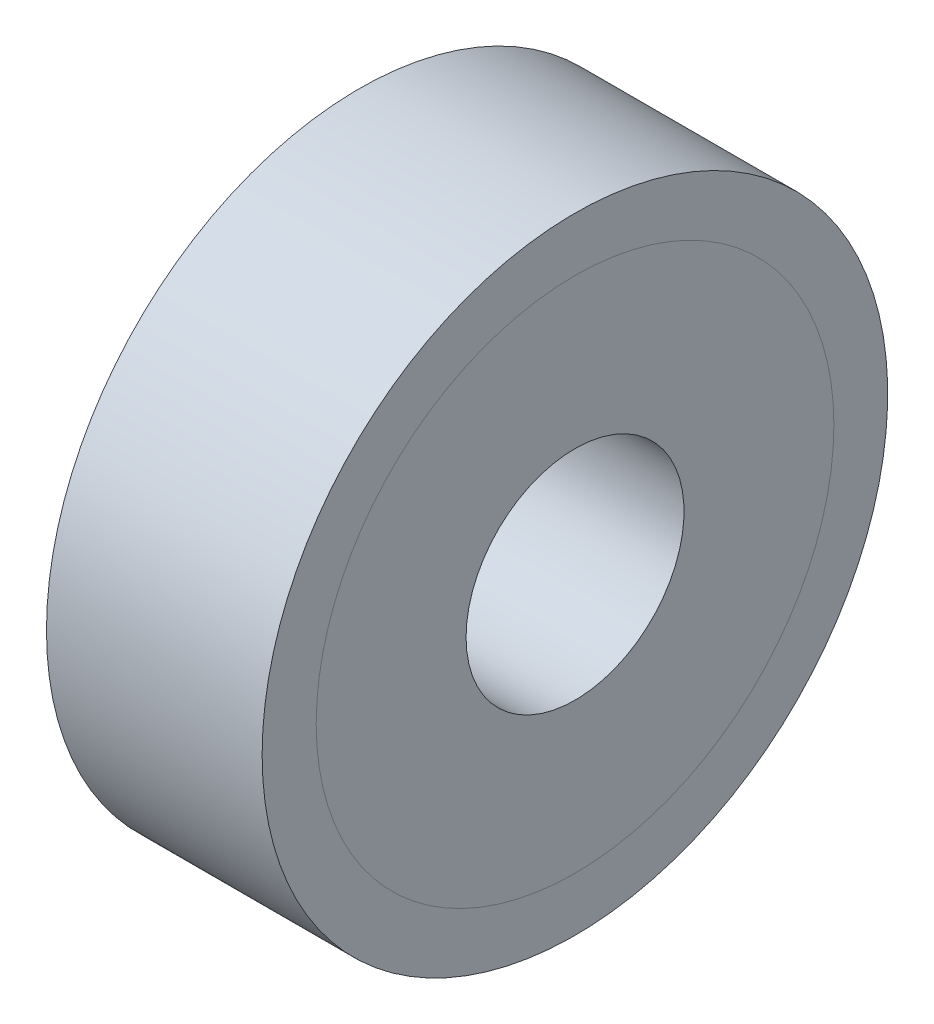
ISO-10303-21;
HEADER;
FILE_DESCRIPTION(('STEP AP214'),'2;1');
FILE_NAME('part.step','',(''),(''),'','','');
FILE_SCHEMA(('AUTOMOTIVE_DESIGN { 1 0 10303 214 1 1 1 1 }'));
ENDSEC;
DATA;
#1=APPLICATION_CONTEXT('core data for automotive mechanical design processes');
#2=APPLICATION_PROTOCOL_DEFINITION('international standard','automotive_design',2000,#1);
#3=PRODUCT_CONTEXT('',#1,'mechanical');
#4=PRODUCT('Part','Part','',(#3));
#5=PRODUCT_RELATED_PRODUCT_CATEGORY('part','',(#4));
#6=PRODUCT_DEFINITION_FORMATION('','',#4);
#7=PRODUCT_DEFINITION_CONTEXT('part definition',#1,'design');
#8=PRODUCT_DEFINITION('design','',#6,#7);
#9=PRODUCT_DEFINITION_SHAPE('','',#8);
#10=(LENGTH_UNIT() NAMED_UNIT(*) SI_UNIT(.MILLI.,.METRE.));
#11=(NAMED_UNIT(*) PLANE_ANGLE_UNIT() SI_UNIT($,.RADIAN.));
#12=(NAMED_UNIT(*) SI_UNIT($,.STERADIAN.) SOLID_ANGLE_UNIT());
#13=UNCERTAINTY_MEASURE_WITH_UNIT(LENGTH_MEASURE(1.E-05),#10,'distance_accuracy_value','');
#14=(GEOMETRIC_REPRESENTATION_CONTEXT(3) GLOBAL_UNCERTAINTY_ASSIGNED_CONTEXT((#13)) GLOBAL_UNIT_ASSIGNED_CONTEXT((#10,
#11,#12)) REPRESENTATION_CONTEXT('',''));
#15=CARTESIAN_POINT('',(0.,0.,0.));
#16=DIRECTION('',(0.,0.,1.));
#17=DIRECTION('',(1.,0.,0.));
#18=AXIS2_PLACEMENT_3D('',#15,#16,#17);
#19=CARTESIAN_POINT('',(0.,0.,0.));
#20=DIRECTION('',(-1.,0.,0.));
#21=DIRECTION('',(0.,0.,1.));
#22=AXIS2_PLACEMENT_3D('',#19,#20,#21);
#23=CYLINDRICAL_SURFACE('',#22,23.02);
#24=CARTESIAN_POINT('',(15.8711816664004,0.,0.));
#25=DIRECTION('',(-1.,0.,0.));
#26=DIRECTION('',(0.,0.,1.));
#27=AXIS2_PLACEMENT_3D('',#24,#25,#26);
#28=CIRCLE('',#27,23.02);
#29=CARTESIAN_POINT('',(15.8711816664004,0.,23.02));
#30=VERTEX_POINT('',#29);
#31=EDGE_CURVE('E34',#30,#30,#28,.T.);
#32=ORIENTED_EDGE('',*,*,#31,.T.);
#33=EDGE_LOOP('',(#32));
#34=FACE_BOUND('',#33,.T.);
#35=CARTESIAN_POINT('',(0.,0.,0.));
#36=DIRECTION('',(-1.,0.,0.));
#37=DIRECTION('',(0.,0.,1.));
#38=AXIS2_PLACEMENT_3D('',#35,#36,#37);
#39=CIRCLE('',#38,23.02);
#40=CARTESIAN_POINT('',(0.,0.,23.02));
#41=VERTEX_POINT('',#40);
#42=EDGE_CURVE('E10',#41,#41,#39,.T.);
#43=ORIENTED_EDGE('',*,*,#42,.F.);
#44=EDGE_LOOP('',(#43));
#45=FACE_BOUND('',#44,.T.);
#46=ADVANCED_FACE('F15',(#34,#45),#23,.T.);
#47=CARTESIAN_POINT('',(0.,0.,0.));
#48=DIRECTION('',(-1.,0.,0.));
#49=DIRECTION('',(0.,0.,1.));
#50=AXIS2_PLACEMENT_3D('',#47,#48,#49);
#51=PLANE('',#50);
#52=ORIENTED_EDGE('',*,*,#42,.T.);
#53=EDGE_LOOP('',(#52));
#54=FACE_BOUND('',#53,.T.);
#55=CARTESIAN_POINT('',(0.,0.,0.));
#56=DIRECTION('',(-1.,0.,0.));
#57=DIRECTION('',(0.,0.,1.));
#58=AXIS2_PLACEMENT_3D('',#55,#56,#57);
#59=CIRCLE('',#58,8.02000000000016);
#60=CARTESIAN_POINT('',(0.,0.,8.02000000000016));
#61=VERTEX_POINT('',#60);
#62=EDGE_CURVE('E21',#61,#61,#59,.T.);
#63=ORIENTED_EDGE('',*,*,#62,.F.);
#64=EDGE_LOOP('',(#63));
#65=FACE_BOUND('',#64,.T.);
#66=ADVANCED_FACE('F54',(#54,#65),#51,.T.);
#67=CARTESIAN_POINT('',(0.,0.,0.));
#68=DIRECTION('',(-1.,0.,0.));
#69=DIRECTION('',(0.,0.,1.));
#70=AXIS2_PLACEMENT_3D('',#67,#68,#69);
#71=CYLINDRICAL_SURFACE('',#70,8.02000000000016);
#72=ORIENTED_EDGE('',*,*,#62,.T.);
#73=EDGE_LOOP('',(#72));
#74=FACE_BOUND('',#73,.T.);
#75=CARTESIAN_POINT('',(15.88,0.,0.));
#76=DIRECTION('',(-1.,0.,0.));
#77=DIRECTION('',(0.,0.,1.));
#78=AXIS2_PLACEMENT_3D('',#75,#76,#77);
#79=CIRCLE('',#78,8.02000000000016);
#80=CARTESIAN_POINT('',(15.88,0.,8.02000000000016));
#81=VERTEX_POINT('',#80);
#82=EDGE_CURVE('E25',#81,#81,#79,.T.);
#83=ORIENTED_EDGE('',*,*,#82,.F.);
#84=EDGE_LOOP('',(#83));
#85=FACE_BOUND('',#84,.T.);
#86=ADVANCED_FACE('F50',(#74,#85),#71,.F.);
#87=CARTESIAN_POINT('',(15.88,0.,0.));
#88=DIRECTION('',(-1.,0.,0.));
#89=DIRECTION('',(0.,0.,1.));
#90=AXIS2_PLACEMENT_3D('',#87,#88,#89);
#91=PLANE('',#90);
#92=CARTESIAN_POINT('',(15.88,0.,0.));
#93=DIRECTION('',(-1.,0.,0.));
#94=DIRECTION('',(0.,0.,1.));
#95=AXIS2_PLACEMENT_3D('',#92,#93,#94);
#96=CIRCLE('',#95,19.05);
#97=CARTESIAN_POINT('',(15.88,0.,19.05));
#98=VERTEX_POINT('',#97);
#99=EDGE_CURVE('E29',#98,#98,#96,.T.);
#100=ORIENTED_EDGE('',*,*,#99,.F.);
#101=EDGE_LOOP('',(#100));
#102=FACE_BOUND('',#101,.T.);
#103=ORIENTED_EDGE('',*,*,#82,.T.);
#104=EDGE_LOOP('',(#103));
#105=FACE_BOUND('',#104,.T.);
#106=ADVANCED_FACE('F42',(#102,#105),#91,.F.);
#107=CARTESIAN_POINT('',(15.8711816664004,0.,0.));
#108=DIRECTION('',(-1.,0.,0.));
#109=DIRECTION('',(0.,0.,1.));
#110=AXIS2_PLACEMENT_3D('',#107,#108,#109);
#111=CONICAL_SURFACE('',#110,23.02,1.56857508772773);
#112=ORIENTED_EDGE('',*,*,#99,.T.);
#113=EDGE_LOOP('',(#112));
#114=FACE_BOUND('',#113,.T.);
#115=ORIENTED_EDGE('',*,*,#31,.F.);
#116=EDGE_LOOP('',(#115));
#117=FACE_BOUND('',#116,.T.);
#118=ADVANCED_FACE('F40',(#114,#117),#111,.T.);
#119=CLOSED_SHELL('',(#46,#66,#86,#106,#118));
#120=MANIFOLD_SOLID_BREP('B1',#119);
#121=ADVANCED_BREP_SHAPE_REPRESENTATION('',(#18,#120),#14);
#122=SHAPE_DEFINITION_REPRESENTATION(#9,#121);
ENDSEC;
END-ISO-10303-21;
